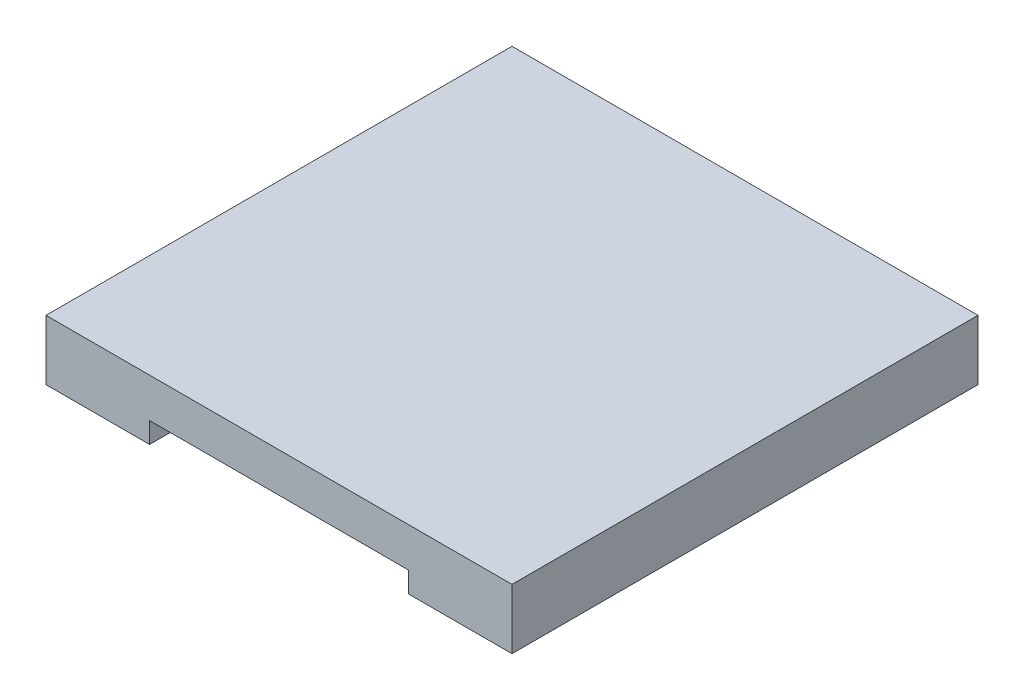
ISO-10303-21;
HEADER;
FILE_DESCRIPTION(('STEP AP214'),'2;1');
FILE_NAME('part.step','',(''),(''),'','','');
FILE_SCHEMA(('AUTOMOTIVE_DESIGN { 1 0 10303 214 1 1 1 1 }'));
ENDSEC;
DATA;
#1=APPLICATION_CONTEXT('core data for automotive mechanical design processes');
#2=APPLICATION_PROTOCOL_DEFINITION('international standard','automotive_design',2000,#1);
#3=PRODUCT_CONTEXT('',#1,'mechanical');
#4=PRODUCT('Part','Part','',(#3));
#5=PRODUCT_RELATED_PRODUCT_CATEGORY('part','',(#4));
#6=PRODUCT_DEFINITION_FORMATION('','',#4);
#7=PRODUCT_DEFINITION_CONTEXT('part definition',#1,'design');
#8=PRODUCT_DEFINITION('design','',#6,#7);
#9=PRODUCT_DEFINITION_SHAPE('','',#8);
#10=(LENGTH_UNIT() NAMED_UNIT(*) SI_UNIT(.MILLI.,.METRE.));
#11=(NAMED_UNIT(*) PLANE_ANGLE_UNIT() SI_UNIT($,.RADIAN.));
#12=(NAMED_UNIT(*) SI_UNIT($,.STERADIAN.) SOLID_ANGLE_UNIT());
#13=UNCERTAINTY_MEASURE_WITH_UNIT(LENGTH_MEASURE(1.E-05),#10,'distance_accuracy_value','');
#14=(GEOMETRIC_REPRESENTATION_CONTEXT(3) GLOBAL_UNCERTAINTY_ASSIGNED_CONTEXT((#13)) GLOBAL_UNIT_ASSIGNED_CONTEXT((#10,
#11,#12)) REPRESENTATION_CONTEXT('',''));
#15=CARTESIAN_POINT('',(0.,0.,0.));
#16=DIRECTION('',(0.,0.,1.));
#17=DIRECTION('',(1.,0.,0.));
#18=AXIS2_PLACEMENT_3D('',#15,#16,#17);
#19=CARTESIAN_POINT('',(0.,79.,0.));
#20=DIRECTION('',(0.,1.,0.));
#21=DIRECTION('',(0.,0.,1.));
#22=AXIS2_PLACEMENT_3D('',#19,#20,#21);
#23=PLANE('',#22);
#24=DIRECTION('',(-1.,0.,0.));
#25=VECTOR('',#24,1.);
#26=CARTESIAN_POINT('',(-45.,79.,-45.));
#27=LINE('',#26,#25);
#28=CARTESIAN_POINT('',(7.49999999999999,79.,-45.));
#29=VERTEX_POINT('',#28);
#30=CARTESIAN_POINT('',(-7.50000000000001,79.,-45.));
#31=VERTEX_POINT('',#30);
#32=EDGE_CURVE('E212',#29,#31,#27,.T.);
#33=ORIENTED_EDGE('',*,*,#32,.F.);
#34=DIRECTION('',(0.,0.,-1.));
#35=VECTOR('',#34,1.);
#36=CARTESIAN_POINT('',(7.49999999999999,79.,-45.));
#37=LINE('',#36,#35);
#38=CARTESIAN_POINT('',(7.49999999999999,79.,-27.2));
#39=VERTEX_POINT('',#38);
#40=EDGE_CURVE('E11',#39,#29,#37,.T.);
#41=ORIENTED_EDGE('',*,*,#40,.F.);
#42=DIRECTION('',(-1.,0.,0.));
#43=VECTOR('',#42,1.);
#44=CARTESIAN_POINT('',(45.,79.,-27.2));
#45=LINE('',#44,#43);
#46=CARTESIAN_POINT('',(-7.50000000000001,79.,-27.2));
#47=VERTEX_POINT('',#46);
#48=EDGE_CURVE('E210',#39,#47,#45,.T.);
#49=ORIENTED_EDGE('',*,*,#48,.T.);
#50=DIRECTION('',(0.,0.,1.));
#51=VECTOR('',#50,1.);
#52=CARTESIAN_POINT('',(-7.50000000000001,79.,-45.));
#53=LINE('',#52,#51);
#54=EDGE_CURVE('E220',#31,#47,#53,.T.);
#55=ORIENTED_EDGE('',*,*,#54,.F.);
#56=EDGE_LOOP('',(#33,#41,#49,#55));
#57=FACE_BOUND('',#56,.T.);
#58=DIRECTION('',(0.,0.,1.));
#59=VECTOR('',#58,1.);
#60=CARTESIAN_POINT('',(4.09999999999999,79.,-41.75));
#61=LINE('',#60,#59);
#62=CARTESIAN_POINT('',(4.09999999999999,79.,-41.75));
#63=VERTEX_POINT('',#62);
#64=CARTESIAN_POINT('',(4.09999999999999,79.,-30.45));
#65=VERTEX_POINT('',#64);
#66=EDGE_CURVE('E50',#63,#65,#61,.T.);
#67=ORIENTED_EDGE('',*,*,#66,.F.);
#68=DIRECTION('',(1.,0.,0.));
#69=VECTOR('',#68,1.);
#70=CARTESIAN_POINT('',(4.09999999999999,79.,-41.75));
#71=LINE('',#70,#69);
#72=CARTESIAN_POINT('',(-4.1,79.,-41.75));
#73=VERTEX_POINT('',#72);
#74=EDGE_CURVE('E54',#73,#63,#71,.T.);
#75=ORIENTED_EDGE('',*,*,#74,.F.);
#76=DIRECTION('',(0.,0.,-1.));
#77=VECTOR('',#76,1.);
#78=CARTESIAN_POINT('',(-4.1,79.,-41.75));
#79=LINE('',#78,#77);
#80=CARTESIAN_POINT('',(-4.1,79.,-30.45));
#81=VERTEX_POINT('',#80);
#82=EDGE_CURVE('E679',#81,#73,#79,.T.);
#83=ORIENTED_EDGE('',*,*,#82,.F.);
#84=DIRECTION('',(-1.,0.,0.));
#85=VECTOR('',#84,1.);
#86=CARTESIAN_POINT('',(4.09999999999999,79.,-30.45));
#87=LINE('',#86,#85);
#88=EDGE_CURVE('E685',#65,#81,#87,.T.);
#89=ORIENTED_EDGE('',*,*,#88,.F.);
#90=EDGE_LOOP('',(#67,#75,#83,#89));
#91=FACE_BOUND('',#90,.T.);
#92=ADVANCED_FACE('F35',(#57,#91),#23,.F.);
#93=CARTESIAN_POINT('',(0.,91.4,0.));
#94=DIRECTION('',(0.,1.,0.));
#95=DIRECTION('',(0.,0.,1.));
#96=AXIS2_PLACEMENT_3D('',#93,#94,#95);
#97=PLANE('',#96);
#98=DIRECTION('',(1.,0.,0.));
#99=VECTOR('',#98,1.);
#100=CARTESIAN_POINT('',(45.,91.4,-25.2));
#101=LINE('',#100,#99);
#102=CARTESIAN_POINT('',(25.,91.4,-25.2));
#103=VERTEX_POINT('',#102);
#104=CARTESIAN_POINT('',(25.7966933112238,91.4,-25.2));
#105=VERTEX_POINT('',#104);
#106=EDGE_CURVE('E338',#103,#105,#101,.T.);
#107=ORIENTED_EDGE('',*,*,#106,.T.);
#108=DIRECTION('',(0.,0.,1.));
#109=VECTOR('',#108,1.);
#110=CARTESIAN_POINT('',(25.7966933112238,91.4,-45.));
#111=LINE('',#110,#109);
#112=CARTESIAN_POINT('',(25.7966933112238,91.4,-45.));
#113=VERTEX_POINT('',#112);
#114=EDGE_CURVE('E307',#105,#113,#111,.F.);
#115=ORIENTED_EDGE('',*,*,#114,.T.);
#116=DIRECTION('',(-1.,0.,0.));
#117=VECTOR('',#116,1.);
#118=CARTESIAN_POINT('',(-45.,91.4,-45.));
#119=LINE('',#118,#117);
#120=CARTESIAN_POINT('',(45.,91.4,-45.));
#121=VERTEX_POINT('',#120);
#122=EDGE_CURVE('E245',#121,#113,#119,.T.);
#123=ORIENTED_EDGE('',*,*,#122,.F.);
#124=DIRECTION('',(0.,0.,-1.));
#125=VECTOR('',#124,1.);
#126=CARTESIAN_POINT('',(45.,91.4,-45.));
#127=LINE('',#126,#125);
#128=CARTESIAN_POINT('',(45.,91.4,45.));
#129=VERTEX_POINT('',#128);
#130=EDGE_CURVE('E258',#129,#121,#127,.T.);
#131=ORIENTED_EDGE('',*,*,#130,.F.);
#132=DIRECTION('',(1.,0.,0.));
#133=VECTOR('',#132,1.);
#134=CARTESIAN_POINT('',(-45.,91.4,45.));
#135=LINE('',#134,#133);
#136=CARTESIAN_POINT('',(25.,91.4,45.));
#137=VERTEX_POINT('',#136);
#138=EDGE_CURVE('E254',#137,#129,#135,.T.);
#139=ORIENTED_EDGE('',*,*,#138,.F.);
#140=DIRECTION('',(0.,0.,1.));
#141=VECTOR('',#140,1.);
#142=CARTESIAN_POINT('',(25.,91.4,-27.2));
#143=LINE('',#142,#141);
#144=EDGE_CURVE('E238',#103,#137,#143,.T.);
#145=ORIENTED_EDGE('',*,*,#144,.F.);
#146=EDGE_LOOP('',(#107,#115,#123,#131,#139,#145));
#147=FACE_BOUND('',#146,.T.);
#148=ADVANCED_FACE('F396',(#147),#97,.F.);
#149=CARTESIAN_POINT('',(-45.,4.,-45.));
#150=DIRECTION('',(0.,0.,1.));
#151=DIRECTION('',(1.,0.,0.));
#152=AXIS2_PLACEMENT_3D('',#149,#150,#151);
#153=PLANE('',#152);
#154=DIRECTION('',(0.,-1.,0.));
#155=VECTOR('',#154,1.);
#156=CARTESIAN_POINT('',(7.49999999999999,91.4,-45.));
#157=LINE('',#156,#155);
#158=CARTESIAN_POINT('',(7.49999999999999,79.6590323935863,-45.));
#159=VERTEX_POINT('',#158);
#160=EDGE_CURVE('E277',#159,#29,#157,.T.);
#161=ORIENTED_EDGE('',*,*,#160,.T.);
#162=ORIENTED_EDGE('',*,*,#32,.T.);
#163=DIRECTION('',(0.,-1.,0.));
#164=VECTOR('',#163,1.);
#165=CARTESIAN_POINT('',(-7.50000000000001,91.4,-45.));
#166=LINE('',#165,#164);
#167=CARTESIAN_POINT('',(-7.50000000000001,79.6590323935863,-45.));
#168=VERTEX_POINT('',#167);
#169=EDGE_CURVE('E274',#168,#31,#166,.T.);
#170=ORIENTED_EDGE('',*,*,#169,.F.);
#171=CARTESIAN_POINT('',(-10.5,79.6590323935863,-45.));
#172=DIRECTION('',(0.,0.,1.));
#173=DIRECTION('',(1.,0.,0.));
#174=AXIS2_PLACEMENT_3D('',#171,#172,#173);
#175=CIRCLE('',#174,3.);
#176=CARTESIAN_POINT('',(-9.01158318492949,82.2637618199597,-45.));
#177=VERTEX_POINT('',#176);
#178=EDGE_CURVE('E319',#168,#177,#175,.T.);
#179=ORIENTED_EDGE('',*,*,#178,.T.);
#180=DIRECTION('',(0.868243142124459,-0.496138938356835,0.));
#181=VECTOR('',#180,1.);
#182=CARTESIAN_POINT('',(-2.42769230769218,78.5015384615384,-45.));
#183=LINE('',#182,#181);
#184=CARTESIAN_POINT('',(-24.3082764961533,91.0047294263734,-45.));
#185=VERTEX_POINT('',#184);
#186=EDGE_CURVE('E288',#177,#185,#183,.F.);
#187=ORIENTED_EDGE('',*,*,#186,.T.);
#188=CARTESIAN_POINT('',(-25.7966933112238,88.4,-45.));
#189=DIRECTION('',(0.,0.,1.));
#190=DIRECTION('',(1.,0.,0.));
#191=AXIS2_PLACEMENT_3D('',#188,#189,#190);
#192=CIRCLE('',#191,3.);
#193=CARTESIAN_POINT('',(-25.7966933112238,91.4,-45.));
#194=VERTEX_POINT('',#193);
#195=EDGE_CURVE('E317',#185,#194,#192,.T.);
#196=ORIENTED_EDGE('',*,*,#195,.T.);
#197=CARTESIAN_POINT('',(-45.,91.4,-45.));
#198=VERTEX_POINT('',#197);
#199=EDGE_CURVE('E260',#194,#198,#119,.T.);
#200=ORIENTED_EDGE('',*,*,#199,.T.);
#201=DIRECTION('',(0.,-1.,0.));
#202=VECTOR('',#201,1.);
#203=CARTESIAN_POINT('',(-45.,103.,-45.));
#204=LINE('',#203,#202);
#205=CARTESIAN_POINT('',(-45.,103.,-45.));
#206=VERTEX_POINT('',#205);
#207=EDGE_CURVE('E251',#206,#198,#204,.T.);
#208=ORIENTED_EDGE('',*,*,#207,.F.);
#209=DIRECTION('',(-1.,0.,0.));
#210=VECTOR('',#209,1.);
#211=CARTESIAN_POINT('',(-45.,103.,-45.));
#212=LINE('',#211,#210);
#213=CARTESIAN_POINT('',(45.,103.,-45.));
#214=VERTEX_POINT('',#213);
#215=EDGE_CURVE('E249',#214,#206,#212,.T.);
#216=ORIENTED_EDGE('',*,*,#215,.F.);
#217=DIRECTION('',(0.,-1.,0.));
#218=VECTOR('',#217,1.);
#219=CARTESIAN_POINT('',(45.,103.,-45.));
#220=LINE('',#219,#218);
#221=EDGE_CURVE('E265',#214,#121,#220,.T.);
#222=ORIENTED_EDGE('',*,*,#221,.T.);
#223=ORIENTED_EDGE('',*,*,#122,.T.);
#224=CARTESIAN_POINT('',(25.7966933112238,88.4,-45.));
#225=DIRECTION('',(0.,0.,1.));
#226=DIRECTION('',(1.,0.,0.));
#227=AXIS2_PLACEMENT_3D('',#224,#225,#226);
#228=CIRCLE('',#227,3.);
#229=CARTESIAN_POINT('',(24.3082764961533,91.0047294263734,-45.));
#230=VERTEX_POINT('',#229);
#231=EDGE_CURVE('E323',#113,#230,#228,.T.);
#232=ORIENTED_EDGE('',*,*,#231,.T.);
#233=DIRECTION('',(0.868243142124459,0.496138938356835,0.));
#234=VECTOR('',#233,1.);
#235=CARTESIAN_POINT('',(-65.4184615384615,39.7323076923076,-45.));
#236=LINE('',#235,#234);
#237=CARTESIAN_POINT('',(9.01158318492949,82.2637618199597,-45.));
#238=VERTEX_POINT('',#237);
#239=EDGE_CURVE('E291',#230,#238,#236,.F.);
#240=ORIENTED_EDGE('',*,*,#239,.T.);
#241=CARTESIAN_POINT('',(10.5,79.6590323935863,-45.));
#242=DIRECTION('',(0.,0.,1.));
#243=DIRECTION('',(1.,0.,0.));
#244=AXIS2_PLACEMENT_3D('',#241,#242,#243);
#245=CIRCLE('',#244,3.);
#246=EDGE_CURVE('E327',#238,#159,#245,.T.);
#247=ORIENTED_EDGE('',*,*,#246,.T.);
#248=EDGE_LOOP('',(#161,#162,#170,#179,#187,#196,#200,#208,#216,#222,#223,#232,#240,#247));
#249=FACE_BOUND('',#248,.T.);
#250=ADVANCED_FACE('F382',(#249),#153,.F.);
#251=CARTESIAN_POINT('',(45.,41.4,-27.2));
#252=DIRECTION('',(0.,0.,1.));
#253=DIRECTION('',(1.,0.,0.));
#254=AXIS2_PLACEMENT_3D('',#251,#252,#253);
#255=PLANE('',#254);
#256=ORIENTED_EDGE('',*,*,#48,.F.);
#257=DIRECTION('',(0.,-1.,0.));
#258=VECTOR('',#257,1.);
#259=CARTESIAN_POINT('',(7.49999999999999,91.4,-27.2));
#260=LINE('',#259,#258);
#261=CARTESIAN_POINT('',(7.49999999999999,79.6590323935863,-27.2));
#262=VERTEX_POINT('',#261);
#263=EDGE_CURVE('E280',#262,#39,#260,.T.);
#264=ORIENTED_EDGE('',*,*,#263,.F.);
#265=CARTESIAN_POINT('',(10.5,79.6590323935863,-27.2));
#266=DIRECTION('',(0.,0.,1.));
#267=DIRECTION('',(1.,0.,0.));
#268=AXIS2_PLACEMENT_3D('',#265,#266,#267);
#269=CIRCLE('',#268,3.);
#270=CARTESIAN_POINT('',(9.01158318492948,82.2637618199597,-27.2));
#271=VERTEX_POINT('',#270);
#272=EDGE_CURVE('E325',#262,#271,#269,.F.);
#273=ORIENTED_EDGE('',*,*,#272,.T.);
#274=DIRECTION('',(-0.868243142124459,-0.496138938356835,0.));
#275=VECTOR('',#274,1.);
#276=CARTESIAN_POINT('',(24.9999999999999,91.4,-27.2));
#277=LINE('',#276,#275);
#278=CARTESIAN_POINT('',(23.2499999999999,90.4,-27.2));
#279=VERTEX_POINT('',#278);
#280=EDGE_CURVE('E294',#271,#279,#277,.F.);
#281=ORIENTED_EDGE('',*,*,#280,.T.);
#282=DIRECTION('',(-1.,0.,0.));
#283=VECTOR('',#282,1.);
#284=CARTESIAN_POINT('',(45.,90.4,-27.2));
#285=LINE('',#284,#283);
#286=CARTESIAN_POINT('',(-23.2499999999999,90.4,-27.2));
#287=VERTEX_POINT('',#286);
#288=EDGE_CURVE('E329',#279,#287,#285,.T.);
#289=ORIENTED_EDGE('',*,*,#288,.T.);
#290=DIRECTION('',(-0.868243142124459,0.496138938356835,0.));
#291=VECTOR('',#290,1.);
#292=CARTESIAN_POINT('',(-24.9999999999999,91.4,-27.2));
#293=LINE('',#292,#291);
#294=CARTESIAN_POINT('',(-9.0115831849295,82.2637618199597,-27.2));
#295=VERTEX_POINT('',#294);
#296=EDGE_CURVE('E286',#287,#295,#293,.F.);
#297=ORIENTED_EDGE('',*,*,#296,.T.);
#298=CARTESIAN_POINT('',(-10.5,79.6590323935863,-27.2));
#299=DIRECTION('',(0.,0.,1.));
#300=DIRECTION('',(1.,0.,0.));
#301=AXIS2_PLACEMENT_3D('',#298,#299,#300);
#302=CIRCLE('',#301,3.);
#303=CARTESIAN_POINT('',(-7.5,79.6590323935863,-27.2));
#304=VERTEX_POINT('',#303);
#305=EDGE_CURVE('E321',#295,#304,#302,.F.);
#306=ORIENTED_EDGE('',*,*,#305,.T.);
#307=DIRECTION('',(0.,-1.,0.));
#308=VECTOR('',#307,1.);
#309=CARTESIAN_POINT('',(-7.5,91.4,-27.2));
#310=LINE('',#309,#308);
#311=EDGE_CURVE('E283',#304,#47,#310,.T.);
#312=ORIENTED_EDGE('',*,*,#311,.T.);
#313=EDGE_LOOP('',(#256,#264,#273,#281,#289,#297,#306,#312));
#314=FACE_BOUND('',#313,.T.);
#315=ADVANCED_FACE('F363',(#314),#255,.T.);
#316=CARTESIAN_POINT('',(-7.50000000000001,91.4,-45.));
#317=DIRECTION('',(1.,0.,0.));
#318=DIRECTION('',(0.,0.,-1.));
#319=AXIS2_PLACEMENT_3D('',#316,#317,#318);
#320=PLANE('',#319);
#321=ORIENTED_EDGE('',*,*,#169,.T.);
#322=ORIENTED_EDGE('',*,*,#54,.T.);
#323=ORIENTED_EDGE('',*,*,#311,.F.);
#324=DIRECTION('',(0.,0.,1.));
#325=VECTOR('',#324,1.);
#326=CARTESIAN_POINT('',(-7.50000000000001,79.6590323935863,-45.));
#327=LINE('',#326,#325);
#328=EDGE_CURVE('E304',#304,#168,#327,.F.);
#329=ORIENTED_EDGE('',*,*,#328,.T.);
#330=EDGE_LOOP('',(#321,#322,#323,#329));
#331=FACE_BOUND('',#330,.T.);
#332=ADVANCED_FACE('F378',(#331),#320,.F.);
#333=CARTESIAN_POINT('',(7.49999999999999,91.4,-45.));
#334=DIRECTION('',(-1.,0.,0.));
#335=DIRECTION('',(0.,0.,1.));
#336=AXIS2_PLACEMENT_3D('',#333,#334,#335);
#337=PLANE('',#336);
#338=ORIENTED_EDGE('',*,*,#263,.T.);
#339=ORIENTED_EDGE('',*,*,#40,.T.);
#340=ORIENTED_EDGE('',*,*,#160,.F.);
#341=DIRECTION('',(0.,0.,-1.));
#342=VECTOR('',#341,1.);
#343=CARTESIAN_POINT('',(7.49999999999999,79.6590323935863,-27.2));
#344=LINE('',#343,#342);
#345=EDGE_CURVE('E314',#159,#262,#344,.F.);
#346=ORIENTED_EDGE('',*,*,#345,.T.);
#347=EDGE_LOOP('',(#338,#339,#340,#346));
#348=FACE_BOUND('',#347,.T.);
#349=ADVANCED_FACE('F387',(#348),#337,.F.);
#350=DIRECTION('',(0.,0.,-1.));
#351=VECTOR('',#350,1.);
#352=CARTESIAN_POINT('',(-25.7966933112238,91.4,-27.2));
#353=LINE('',#352,#351);
#354=CARTESIAN_POINT('',(-25.7966933112238,91.4,-25.2));
#355=VERTEX_POINT('',#354);
#356=EDGE_CURVE('E297',#194,#355,#353,.F.);
#357=ORIENTED_EDGE('',*,*,#356,.T.);
#358=DIRECTION('',(1.,0.,0.));
#359=VECTOR('',#358,1.);
#360=CARTESIAN_POINT('',(45.,91.4,-25.2));
#361=LINE('',#360,#359);
#362=CARTESIAN_POINT('',(-25.,91.4,-25.2));
#363=VERTEX_POINT('',#362);
#364=EDGE_CURVE('E332',#355,#363,#361,.T.);
#365=ORIENTED_EDGE('',*,*,#364,.T.);
#366=DIRECTION('',(0.,0.,1.));
#367=VECTOR('',#366,1.);
#368=CARTESIAN_POINT('',(-25.,91.4,-27.2));
#369=LINE('',#368,#367);
#370=CARTESIAN_POINT('',(-25.,91.4,45.));
#371=VERTEX_POINT('',#370);
#372=EDGE_CURVE('E232',#363,#371,#369,.T.);
#373=ORIENTED_EDGE('',*,*,#372,.T.);
#374=CARTESIAN_POINT('',(-45.,91.4,45.));
#375=VERTEX_POINT('',#374);
#376=EDGE_CURVE('E255',#375,#371,#135,.T.);
#377=ORIENTED_EDGE('',*,*,#376,.F.);
#378=DIRECTION('',(0.,0.,1.));
#379=VECTOR('',#378,1.);
#380=CARTESIAN_POINT('',(-45.,91.4,-45.));
#381=LINE('',#380,#379);
#382=EDGE_CURVE('E235',#198,#375,#381,.T.);
#383=ORIENTED_EDGE('',*,*,#382,.F.);
#384=ORIENTED_EDGE('',*,*,#199,.F.);
#385=EDGE_LOOP('',(#357,#365,#373,#377,#383,#384));
#386=FACE_BOUND('',#385,.T.);
#387=ADVANCED_FACE('F416',(#386),#97,.F.);
#388=CARTESIAN_POINT('',(-45.,103.,-45.));
#389=DIRECTION('',(1.,0.,0.));
#390=DIRECTION('',(0.,0.,-1.));
#391=AXIS2_PLACEMENT_3D('',#388,#389,#390);
#392=PLANE('',#391);
#393=ORIENTED_EDGE('',*,*,#382,.T.);
#394=DIRECTION('',(0.,-1.,0.));
#395=VECTOR('',#394,1.);
#396=CARTESIAN_POINT('',(-45.,103.,45.));
#397=LINE('',#396,#395);
#398=CARTESIAN_POINT('',(-45.,103.,45.));
#399=VERTEX_POINT('',#398);
#400=EDGE_CURVE('E271',#399,#375,#397,.T.);
#401=ORIENTED_EDGE('',*,*,#400,.F.);
#402=DIRECTION('',(0.,0.,1.));
#403=VECTOR('',#402,1.);
#404=CARTESIAN_POINT('',(-45.,103.,-45.));
#405=LINE('',#404,#403);
#406=EDGE_CURVE('E241',#206,#399,#405,.T.);
#407=ORIENTED_EDGE('',*,*,#406,.F.);
#408=ORIENTED_EDGE('',*,*,#207,.T.);
#409=EDGE_LOOP('',(#393,#401,#407,#408));
#410=FACE_BOUND('',#409,.T.);
#411=ADVANCED_FACE('F426',(#410),#392,.F.);
#412=CARTESIAN_POINT('',(-45.,103.,45.));
#413=DIRECTION('',(0.,0.,-1.));
#414=DIRECTION('',(-1.,0.,0.));
#415=AXIS2_PLACEMENT_3D('',#412,#413,#414);
#416=PLANE('',#415);
#417=ORIENTED_EDGE('',*,*,#376,.T.);
#418=DIRECTION('',(0.,-1.,0.));
#419=VECTOR('',#418,1.);
#420=CARTESIAN_POINT('',(-25.,91.4,45.));
#421=LINE('',#420,#419);
#422=CARTESIAN_POINT('',(-25.,95.4,45.));
#423=VERTEX_POINT('',#422);
#424=EDGE_CURVE('E223',#423,#371,#421,.T.);
#425=ORIENTED_EDGE('',*,*,#424,.F.);
#426=DIRECTION('',(-1.,0.,0.));
#427=VECTOR('',#426,1.);
#428=CARTESIAN_POINT('',(-25.,95.4,45.));
#429=LINE('',#428,#427);
#430=CARTESIAN_POINT('',(25.,95.4,45.));
#431=VERTEX_POINT('',#430);
#432=EDGE_CURVE('E229',#431,#423,#429,.T.);
#433=ORIENTED_EDGE('',*,*,#432,.F.);
#434=DIRECTION('',(0.,1.,0.));
#435=VECTOR('',#434,1.);
#436=CARTESIAN_POINT('',(25.,91.4,45.));
#437=LINE('',#436,#435);
#438=EDGE_CURVE('E226',#137,#431,#437,.T.);
#439=ORIENTED_EDGE('',*,*,#438,.F.);
#440=ORIENTED_EDGE('',*,*,#138,.T.);
#441=DIRECTION('',(0.,-1.,0.));
#442=VECTOR('',#441,1.);
#443=CARTESIAN_POINT('',(45.,103.,45.));
#444=LINE('',#443,#442);
#445=CARTESIAN_POINT('',(45.,103.,45.));
#446=VERTEX_POINT('',#445);
#447=EDGE_CURVE('E268',#446,#129,#444,.T.);
#448=ORIENTED_EDGE('',*,*,#447,.F.);
#449=DIRECTION('',(1.,0.,0.));
#450=VECTOR('',#449,1.);
#451=CARTESIAN_POINT('',(-45.,103.,45.));
#452=LINE('',#451,#450);
#453=EDGE_CURVE('E244',#399,#446,#452,.T.);
#454=ORIENTED_EDGE('',*,*,#453,.F.);
#455=ORIENTED_EDGE('',*,*,#400,.T.);
#456=EDGE_LOOP('',(#417,#425,#433,#439,#440,#448,#454,#455));
#457=FACE_BOUND('',#456,.T.);
#458=ADVANCED_FACE('F429',(#457),#416,.F.);
#459=CARTESIAN_POINT('',(45.,103.,-45.));
#460=DIRECTION('',(-1.,0.,0.));
#461=DIRECTION('',(0.,0.,1.));
#462=AXIS2_PLACEMENT_3D('',#459,#460,#461);
#463=PLANE('',#462);
#464=ORIENTED_EDGE('',*,*,#130,.T.);
#465=ORIENTED_EDGE('',*,*,#221,.F.);
#466=DIRECTION('',(0.,0.,-1.));
#467=VECTOR('',#466,1.);
#468=CARTESIAN_POINT('',(45.,103.,-45.));
#469=LINE('',#468,#467);
#470=EDGE_CURVE('E247',#446,#214,#469,.T.);
#471=ORIENTED_EDGE('',*,*,#470,.F.);
#472=ORIENTED_EDGE('',*,*,#447,.T.);
#473=EDGE_LOOP('',(#464,#465,#471,#472));
#474=FACE_BOUND('',#473,.T.);
#475=ADVANCED_FACE('F436',(#474),#463,.F.);
#476=CARTESIAN_POINT('',(0.,103.,0.));
#477=DIRECTION('',(0.,1.,0.));
#478=DIRECTION('',(0.,0.,1.));
#479=AXIS2_PLACEMENT_3D('',#476,#477,#478);
#480=PLANE('',#479);
#481=ORIENTED_EDGE('',*,*,#406,.T.);
#482=ORIENTED_EDGE('',*,*,#453,.T.);
#483=ORIENTED_EDGE('',*,*,#470,.T.);
#484=ORIENTED_EDGE('',*,*,#215,.T.);
#485=EDGE_LOOP('',(#481,#482,#483,#484));
#486=FACE_BOUND('',#485,.T.);
#487=ADVANCED_FACE('F433',(#486),#480,.T.);
#488=CARTESIAN_POINT('',(-25.,91.4,-27.2));
#489=DIRECTION('',(-1.,0.,0.));
#490=DIRECTION('',(0.,-1.,0.));
#491=AXIS2_PLACEMENT_3D('',#488,#489,#490);
#492=PLANE('',#491);
#493=ORIENTED_EDGE('',*,*,#372,.F.);
#494=DIRECTION('',(0.,0.44721359549996,0.894427190999915));
#495=VECTOR('',#494,1.);
#496=CARTESIAN_POINT('',(-25.,90.4,-27.2));
#497=LINE('',#496,#495);
#498=CARTESIAN_POINT('',(-25.,95.4,-17.2000000000001));
#499=VERTEX_POINT('',#498);
#500=EDGE_CURVE('E334',#363,#499,#497,.T.);
#501=ORIENTED_EDGE('',*,*,#500,.T.);
#502=DIRECTION('',(0.,0.,1.));
#503=VECTOR('',#502,1.);
#504=CARTESIAN_POINT('',(-25.,95.4,-27.2));
#505=LINE('',#504,#503);
#506=EDGE_CURVE('E233',#499,#423,#505,.T.);
#507=ORIENTED_EDGE('',*,*,#506,.T.);
#508=ORIENTED_EDGE('',*,*,#424,.T.);
#509=EDGE_LOOP('',(#493,#501,#507,#508));
#510=FACE_BOUND('',#509,.T.);
#511=ADVANCED_FACE('F414',(#510),#492,.F.);
#512=CARTESIAN_POINT('',(-25.,95.4,-27.2));
#513=DIRECTION('',(0.,1.,0.));
#514=DIRECTION('',(0.,0.,1.));
#515=AXIS2_PLACEMENT_3D('',#512,#513,#514);
#516=PLANE('',#515);
#517=ORIENTED_EDGE('',*,*,#506,.F.);
#518=DIRECTION('',(1.,0.,0.));
#519=VECTOR('',#518,1.);
#520=CARTESIAN_POINT('',(-25.,95.4,-17.2000000000001));
#521=LINE('',#520,#519);
#522=CARTESIAN_POINT('',(25.,95.4,-17.2000000000001));
#523=VERTEX_POINT('',#522);
#524=EDGE_CURVE('E336',#499,#523,#521,.T.);
#525=ORIENTED_EDGE('',*,*,#524,.T.);
#526=DIRECTION('',(0.,0.,1.));
#527=VECTOR('',#526,1.);
#528=CARTESIAN_POINT('',(25.,95.4,-27.2));
#529=LINE('',#528,#527);
#530=EDGE_CURVE('E236',#523,#431,#529,.T.);
#531=ORIENTED_EDGE('',*,*,#530,.T.);
#532=ORIENTED_EDGE('',*,*,#432,.T.);
#533=EDGE_LOOP('',(#517,#525,#531,#532));
#534=FACE_BOUND('',#533,.T.);
#535=ADVANCED_FACE('F410',(#534),#516,.F.);
#536=CARTESIAN_POINT('',(25.,91.4,-27.2));
#537=DIRECTION('',(1.,0.,0.));
#538=DIRECTION('',(0.,0.,-1.));
#539=AXIS2_PLACEMENT_3D('',#536,#537,#538);
#540=PLANE('',#539);
#541=ORIENTED_EDGE('',*,*,#530,.F.);
#542=DIRECTION('',(0.,-0.44721359549996,-0.894427190999915));
#543=VECTOR('',#542,1.);
#544=CARTESIAN_POINT('',(25.,90.4,-27.2));
#545=LINE('',#544,#543);
#546=EDGE_CURVE('E341',#523,#103,#545,.T.);
#547=ORIENTED_EDGE('',*,*,#546,.T.);
#548=ORIENTED_EDGE('',*,*,#144,.T.);
#549=ORIENTED_EDGE('',*,*,#438,.T.);
#550=EDGE_LOOP('',(#541,#547,#548,#549));
#551=FACE_BOUND('',#550,.T.);
#552=ADVANCED_FACE('F405',(#551),#540,.F.);
#553=CARTESIAN_POINT('',(-24.9999999999999,91.4,0.));
#554=DIRECTION('',(-0.496138938356835,-0.868243142124459,0.));
#555=DIRECTION('',(0.,0.,-1.));
#556=AXIS2_PLACEMENT_3D('',#553,#554,#555);
#557=PLANE('',#556);
#558=ORIENTED_EDGE('',*,*,#296,.F.);
#559=DIRECTION('',(0.616315634427937,-0.352180362530251,-0.704360725060498));
#560=VECTOR('',#559,1.);
#561=CARTESIAN_POINT('',(-35.9395348837208,97.6511627906977,-12.6976744186047));
#562=LINE('',#561,#560);
#563=CARTESIAN_POINT('',(-24.3082764961533,91.0047294263734,-25.9905411472532));
#564=VERTEX_POINT('',#563);
#565=EDGE_CURVE('E343',#287,#564,#562,.F.);
#566=ORIENTED_EDGE('',*,*,#565,.T.);
#567=DIRECTION('',(0.,0.,1.));
#568=VECTOR('',#567,1.);
#569=CARTESIAN_POINT('',(-24.3082764961533,91.0047294263734,-45.));
#570=LINE('',#569,#568);
#571=EDGE_CURVE('E302',#564,#185,#570,.F.);
#572=ORIENTED_EDGE('',*,*,#571,.T.);
#573=ORIENTED_EDGE('',*,*,#186,.F.);
#574=DIRECTION('',(0.,0.,-1.));
#575=VECTOR('',#574,1.);
#576=CARTESIAN_POINT('',(-9.0115831849295,82.2637618199597,-27.2));
#577=LINE('',#576,#575);
#578=EDGE_CURVE('E299',#177,#295,#577,.F.);
#579=ORIENTED_EDGE('',*,*,#578,.T.);
#580=EDGE_LOOP('',(#558,#566,#572,#573,#579));
#581=FACE_BOUND('',#580,.T.);
#582=ADVANCED_FACE('F370',(#581),#557,.T.);
#583=CARTESIAN_POINT('',(24.9999999999999,91.4,0.));
#584=DIRECTION('',(0.496138938356835,-0.868243142124459,0.));
#585=DIRECTION('',(0.,0.,1.));
#586=AXIS2_PLACEMENT_3D('',#583,#584,#585);
#587=PLANE('',#586);
#588=ORIENTED_EDGE('',*,*,#239,.F.);
#589=DIRECTION('',(0.,0.,-1.));
#590=VECTOR('',#589,1.);
#591=CARTESIAN_POINT('',(24.3082764961533,91.0047294263734,-27.2));
#592=LINE('',#591,#590);
#593=CARTESIAN_POINT('',(24.3082764961533,91.0047294263734,-25.9905411472533));
#594=VERTEX_POINT('',#593);
#595=EDGE_CURVE('E312',#230,#594,#592,.F.);
#596=ORIENTED_EDGE('',*,*,#595,.T.);
#597=DIRECTION('',(0.616315634427937,0.352180362530251,0.704360725060498));
#598=VECTOR('',#597,1.);
#599=CARTESIAN_POINT('',(35.9395348837208,97.6511627906977,-12.6976744186047));
#600=LINE('',#599,#598);
#601=EDGE_CURVE('E43',#594,#279,#600,.F.);
#602=ORIENTED_EDGE('',*,*,#601,.T.);
#603=ORIENTED_EDGE('',*,*,#280,.F.);
#604=DIRECTION('',(0.,0.,1.));
#605=VECTOR('',#604,1.);
#606=CARTESIAN_POINT('',(9.01158318492948,82.2637618199597,-45.));
#607=LINE('',#606,#605);
#608=EDGE_CURVE('E310',#271,#238,#607,.F.);
#609=ORIENTED_EDGE('',*,*,#608,.T.);
#610=EDGE_LOOP('',(#588,#596,#602,#603,#609));
#611=FACE_BOUND('',#610,.T.);
#612=ADVANCED_FACE('F355',(#611),#587,.T.);
#613=CARTESIAN_POINT('',(-25.7966933112238,88.4,0.));
#614=DIRECTION('',(0.,0.,1.));
#615=DIRECTION('',(1.,0.,0.));
#616=AXIS2_PLACEMENT_3D('',#613,#614,#615);
#617=CYLINDRICAL_SURFACE('',#616,3.);
#618=ORIENTED_EDGE('',*,*,#195,.F.);
#619=ORIENTED_EDGE('',*,*,#571,.F.);
#620=CARTESIAN_POINT('',(-25.7966933112238,88.4,-31.2));
#621=DIRECTION('',(0.,0.894427190999915,-0.44721359549996));
#622=DIRECTION('',(0.,0.44721359549996,0.894427190999915));
#623=AXIS2_PLACEMENT_3D('',#620,#621,#622);
#624=ELLIPSE('',#623,6.70820393249934,3.);
#625=EDGE_CURVE('E346',#564,#355,#624,.F.);
#626=ORIENTED_EDGE('',*,*,#625,.T.);
#627=ORIENTED_EDGE('',*,*,#356,.F.);
#628=EDGE_LOOP('',(#618,#619,#626,#627));
#629=FACE_BOUND('',#628,.T.);
#630=ADVANCED_FACE('F421',(#629),#617,.F.);
#631=CARTESIAN_POINT('',(-10.5,79.6590323935863,-45.));
#632=DIRECTION('',(0.,0.,-1.));
#633=DIRECTION('',(-1.,0.,0.));
#634=AXIS2_PLACEMENT_3D('',#631,#632,#633);
#635=CYLINDRICAL_SURFACE('',#634,3.);
#636=ORIENTED_EDGE('',*,*,#305,.F.);
#637=ORIENTED_EDGE('',*,*,#578,.F.);
#638=ORIENTED_EDGE('',*,*,#178,.F.);
#639=ORIENTED_EDGE('',*,*,#328,.F.);
#640=EDGE_LOOP('',(#636,#637,#638,#639));
#641=FACE_BOUND('',#640,.T.);
#642=ADVANCED_FACE('F380',(#641),#635,.F.);
#643=CARTESIAN_POINT('',(25.7966933112238,88.4,0.));
#644=DIRECTION('',(0.,0.,-1.));
#645=DIRECTION('',(-1.,0.,0.));
#646=AXIS2_PLACEMENT_3D('',#643,#644,#645);
#647=CYLINDRICAL_SURFACE('',#646,3.);
#648=ORIENTED_EDGE('',*,*,#114,.F.);
#649=CARTESIAN_POINT('',(25.7966933112238,88.4,-31.2));
#650=DIRECTION('',(0.,0.894427190999915,-0.44721359549996));
#651=DIRECTION('',(0.,-0.44721359549996,-0.894427190999915));
#652=AXIS2_PLACEMENT_3D('',#649,#650,#651);
#653=ELLIPSE('',#652,6.70820393249934,3.);
#654=EDGE_CURVE('E349',#105,#594,#653,.F.);
#655=ORIENTED_EDGE('',*,*,#654,.T.);
#656=ORIENTED_EDGE('',*,*,#595,.F.);
#657=ORIENTED_EDGE('',*,*,#231,.F.);
#658=EDGE_LOOP('',(#648,#655,#656,#657));
#659=FACE_BOUND('',#658,.T.);
#660=ADVANCED_FACE('F394',(#659),#647,.F.);
#661=CARTESIAN_POINT('',(10.5,79.6590323935863,-45.));
#662=DIRECTION('',(0.,0.,1.));
#663=DIRECTION('',(1.,0.,0.));
#664=AXIS2_PLACEMENT_3D('',#661,#662,#663);
#665=CYLINDRICAL_SURFACE('',#664,3.);
#666=ORIENTED_EDGE('',*,*,#246,.F.);
#667=ORIENTED_EDGE('',*,*,#608,.F.);
#668=ORIENTED_EDGE('',*,*,#272,.F.);
#669=ORIENTED_EDGE('',*,*,#345,.F.);
#670=EDGE_LOOP('',(#666,#667,#668,#669));
#671=FACE_BOUND('',#670,.T.);
#672=ADVANCED_FACE('F391',(#671),#665,.F.);
#673=CARTESIAN_POINT('',(45.,90.4,-27.2));
#674=DIRECTION('',(0.,0.894427190999915,-0.44721359549996));
#675=DIRECTION('',(-1.,0.,0.));
#676=AXIS2_PLACEMENT_3D('',#673,#674,#675);
#677=PLANE('',#676);
#678=ORIENTED_EDGE('',*,*,#546,.F.);
#679=ORIENTED_EDGE('',*,*,#524,.F.);
#680=ORIENTED_EDGE('',*,*,#500,.F.);
#681=ORIENTED_EDGE('',*,*,#364,.F.);
#682=ORIENTED_EDGE('',*,*,#625,.F.);
#683=ORIENTED_EDGE('',*,*,#565,.F.);
#684=ORIENTED_EDGE('',*,*,#288,.F.);
#685=ORIENTED_EDGE('',*,*,#601,.F.);
#686=ORIENTED_EDGE('',*,*,#654,.F.);
#687=ORIENTED_EDGE('',*,*,#106,.F.);
#688=EDGE_LOOP('',(#678,#679,#680,#681,#682,#683,#684,#685,#686,#687));
#689=FACE_BOUND('',#688,.T.);
#690=ADVANCED_FACE('F37',(#689),#677,.F.);
#691=CARTESIAN_POINT('',(4.09999999999999,64.,-41.75));
#692=DIRECTION('',(-1.,0.,0.));
#693=DIRECTION('',(0.,0.,1.));
#694=AXIS2_PLACEMENT_3D('',#691,#692,#693);
#695=PLANE('',#694);
#696=ORIENTED_EDGE('',*,*,#66,.T.);
#697=DIRECTION('',(0.,1.,0.));
#698=VECTOR('',#697,1.);
#699=CARTESIAN_POINT('',(4.09999999999999,64.,-30.45));
#700=LINE('',#699,#698);
#701=CARTESIAN_POINT('',(4.09999999999999,64.,-30.45));
#702=VERTEX_POINT('',#701);
#703=EDGE_CURVE('E193',#702,#65,#700,.T.);
#704=ORIENTED_EDGE('',*,*,#703,.F.);
#705=DIRECTION('',(0.,0.,1.));
#706=VECTOR('',#705,1.);
#707=CARTESIAN_POINT('',(4.09999999999999,64.,-41.75));
#708=LINE('',#707,#706);
#709=CARTESIAN_POINT('',(4.09999999999999,64.,-41.75));
#710=VERTEX_POINT('',#709);
#711=EDGE_CURVE('E199',#710,#702,#708,.T.);
#712=ORIENTED_EDGE('',*,*,#711,.F.);
#713=DIRECTION('',(0.,1.,0.));
#714=VECTOR('',#713,1.);
#715=CARTESIAN_POINT('',(4.09999999999999,64.,-41.75));
#716=LINE('',#715,#714);
#717=EDGE_CURVE('E677',#710,#63,#716,.T.);
#718=ORIENTED_EDGE('',*,*,#717,.T.);
#719=EDGE_LOOP('',(#696,#704,#712,#718));
#720=FACE_BOUND('',#719,.T.);
#721=ADVANCED_FACE('F209',(#720),#695,.F.);
#722=CARTESIAN_POINT('',(4.09999999999999,64.,-30.45));
#723=DIRECTION('',(0.,0.,-1.));
#724=DIRECTION('',(-1.,0.,0.));
#725=AXIS2_PLACEMENT_3D('',#722,#723,#724);
#726=PLANE('',#725);
#727=ORIENTED_EDGE('',*,*,#88,.T.);
#728=DIRECTION('',(0.,1.,0.));
#729=VECTOR('',#728,1.);
#730=CARTESIAN_POINT('',(-4.1,64.,-30.45));
#731=LINE('',#730,#729);
#732=CARTESIAN_POINT('',(-4.1,64.,-30.45));
#733=VERTEX_POINT('',#732);
#734=EDGE_CURVE('E195',#733,#81,#731,.T.);
#735=ORIENTED_EDGE('',*,*,#734,.F.);
#736=DIRECTION('',(-1.,0.,0.));
#737=VECTOR('',#736,1.);
#738=CARTESIAN_POINT('',(4.09999999999999,64.,-30.45));
#739=LINE('',#738,#737);
#740=EDGE_CURVE('E188',#702,#733,#739,.T.);
#741=ORIENTED_EDGE('',*,*,#740,.F.);
#742=ORIENTED_EDGE('',*,*,#703,.T.);
#743=EDGE_LOOP('',(#727,#735,#741,#742));
#744=FACE_BOUND('',#743,.T.);
#745=ADVANCED_FACE('F191',(#744),#726,.F.);
#746=CARTESIAN_POINT('',(-4.1,64.,-41.75));
#747=DIRECTION('',(1.,0.,0.));
#748=DIRECTION('',(0.,0.,-1.));
#749=AXIS2_PLACEMENT_3D('',#746,#747,#748);
#750=PLANE('',#749);
#751=ORIENTED_EDGE('',*,*,#82,.T.);
#752=DIRECTION('',(0.,1.,0.));
#753=VECTOR('',#752,1.);
#754=CARTESIAN_POINT('',(-4.1,64.,-41.75));
#755=LINE('',#754,#753);
#756=CARTESIAN_POINT('',(-4.1,64.,-41.75));
#757=VERTEX_POINT('',#756);
#758=EDGE_CURVE('E214',#757,#73,#755,.T.);
#759=ORIENTED_EDGE('',*,*,#758,.F.);
#760=DIRECTION('',(0.,0.,-1.));
#761=VECTOR('',#760,1.);
#762=CARTESIAN_POINT('',(-4.1,64.,-41.75));
#763=LINE('',#762,#761);
#764=EDGE_CURVE('E198',#733,#757,#763,.T.);
#765=ORIENTED_EDGE('',*,*,#764,.F.);
#766=ORIENTED_EDGE('',*,*,#734,.T.);
#767=EDGE_LOOP('',(#751,#759,#765,#766));
#768=FACE_BOUND('',#767,.T.);
#769=ADVANCED_FACE('F494',(#768),#750,.F.);
#770=CARTESIAN_POINT('',(4.09999999999999,64.,-41.75));
#771=DIRECTION('',(0.,0.,1.));
#772=DIRECTION('',(1.,0.,0.));
#773=AXIS2_PLACEMENT_3D('',#770,#771,#772);
#774=PLANE('',#773);
#775=ORIENTED_EDGE('',*,*,#74,.T.);
#776=ORIENTED_EDGE('',*,*,#717,.F.);
#777=DIRECTION('',(1.,0.,0.));
#778=VECTOR('',#777,1.);
#779=CARTESIAN_POINT('',(4.09999999999999,64.,-41.75));
#780=LINE('',#779,#778);
#781=EDGE_CURVE('E204',#757,#710,#780,.T.);
#782=ORIENTED_EDGE('',*,*,#781,.F.);
#783=ORIENTED_EDGE('',*,*,#758,.T.);
#784=EDGE_LOOP('',(#775,#776,#782,#783));
#785=FACE_BOUND('',#784,.T.);
#786=ADVANCED_FACE('F498',(#785),#774,.F.);
#787=CARTESIAN_POINT('',(0.,64.,0.));
#788=DIRECTION('',(0.,-1.,0.));
#789=DIRECTION('',(0.,0.,-1.));
#790=AXIS2_PLACEMENT_3D('',#787,#788,#789);
#791=PLANE('',#790);
#792=ORIENTED_EDGE('',*,*,#711,.T.);
#793=ORIENTED_EDGE('',*,*,#740,.T.);
#794=ORIENTED_EDGE('',*,*,#764,.T.);
#795=ORIENTED_EDGE('',*,*,#781,.T.);
#796=EDGE_LOOP('',(#792,#793,#794,#795));
#797=FACE_BOUND('',#796,.T.);
#798=ADVANCED_FACE('F202',(#797),#791,.T.);
#799=CLOSED_SHELL('',(#92,#148,#250,#315,#332,#349,#387,#411,#458,#475,#487,#511,#535,#552,#582,
#612,#630,#642,#660,#672,#690,#721,#745,#769,#786,#798));
#800=MANIFOLD_SOLID_BREP('B2',#799);
#801=ADVANCED_BREP_SHAPE_REPRESENTATION('',(#18,#800),#14);
#802=SHAPE_DEFINITION_REPRESENTATION(#9,#801);
ENDSEC;
END-ISO-10303-21;
